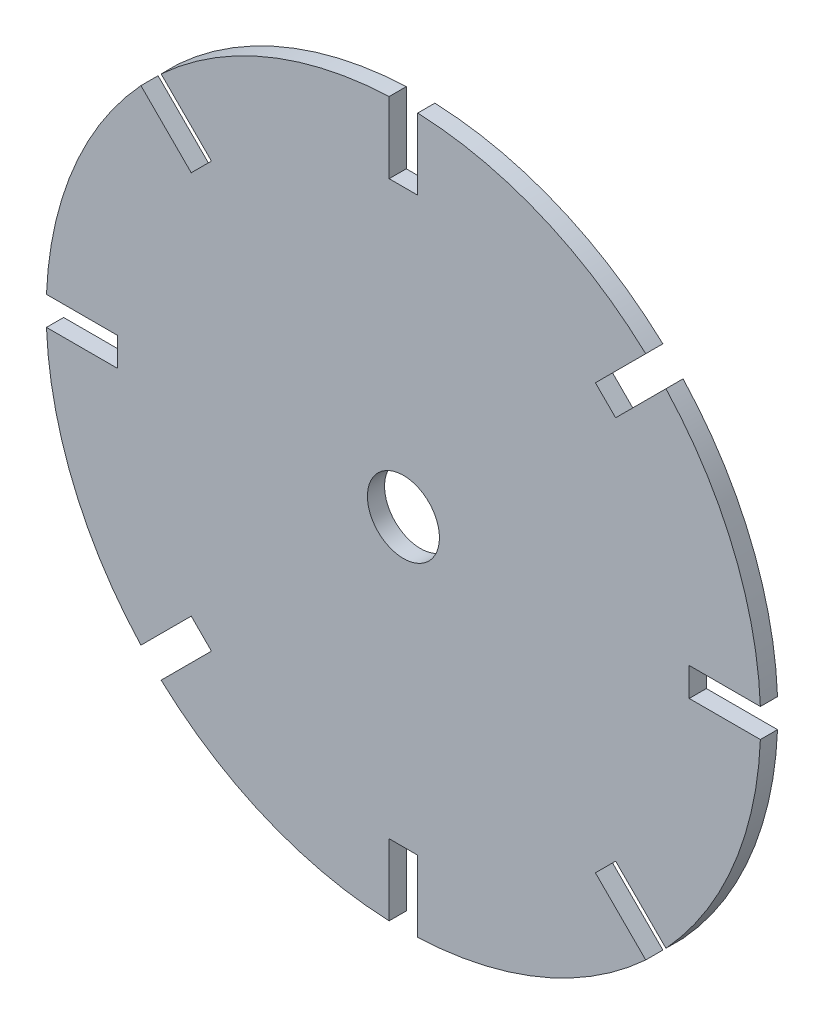
ISO-10303-21;
HEADER;
FILE_DESCRIPTION(('STEP AP214'),'2;1');
FILE_NAME('part.step','',(''),(''),'','','');
FILE_SCHEMA(('AUTOMOTIVE_DESIGN { 1 0 10303 214 1 1 1 1 }'));
ENDSEC;
DATA;
#1=APPLICATION_CONTEXT('core data for automotive mechanical design processes');
#2=APPLICATION_PROTOCOL_DEFINITION('international standard','automotive_design',2000,#1);
#3=PRODUCT_CONTEXT('',#1,'mechanical');
#4=PRODUCT('Part','Part','',(#3));
#5=PRODUCT_RELATED_PRODUCT_CATEGORY('part','',(#4));
#6=PRODUCT_DEFINITION_FORMATION('','',#4);
#7=PRODUCT_DEFINITION_CONTEXT('part definition',#1,'design');
#8=PRODUCT_DEFINITION('design','',#6,#7);
#9=PRODUCT_DEFINITION_SHAPE('','',#8);
#10=(LENGTH_UNIT() NAMED_UNIT(*) SI_UNIT(.MILLI.,.METRE.));
#11=(NAMED_UNIT(*) PLANE_ANGLE_UNIT() SI_UNIT($,.RADIAN.));
#12=(NAMED_UNIT(*) SI_UNIT($,.STERADIAN.) SOLID_ANGLE_UNIT());
#13=UNCERTAINTY_MEASURE_WITH_UNIT(LENGTH_MEASURE(1.E-05),#10,'distance_accuracy_value','');
#14=(GEOMETRIC_REPRESENTATION_CONTEXT(3) GLOBAL_UNCERTAINTY_ASSIGNED_CONTEXT((#13)) GLOBAL_UNIT_ASSIGNED_CONTEXT((#10,
#11,#12)) REPRESENTATION_CONTEXT('',''));
#15=CARTESIAN_POINT('',(0.,0.,0.));
#16=DIRECTION('',(0.,0.,1.));
#17=DIRECTION('',(1.,0.,0.));
#18=AXIS2_PLACEMENT_3D('',#15,#16,#17);
#19=CARTESIAN_POINT('',(0.,0.,6.));
#20=DIRECTION('',(0.,0.,-1.));
#21=DIRECTION('',(-1.,0.,0.));
#22=AXIS2_PLACEMENT_3D('',#19,#20,#21);
#23=CYLINDRICAL_SURFACE('',#22,125.);
#24=CARTESIAN_POINT('',(0.,0.,0.));
#25=DIRECTION('',(0.,0.,1.));
#26=DIRECTION('',(1.,0.,0.));
#27=AXIS2_PLACEMENT_3D('',#24,#25,#26);
#28=CIRCLE('',#27,125.);
#29=CARTESIAN_POINT('',(-5.,124.899959967968,0.));
#30=VERTEX_POINT('',#29);
#31=CARTESIAN_POINT('',(-84.7820747573446,91.8531425692122,0.));
#32=VERTEX_POINT('',#31);
#33=EDGE_CURVE('E449',#30,#32,#28,.T.);
#34=ORIENTED_EDGE('',*,*,#33,.T.);
#35=DIRECTION('',(0.,0.,-1.));
#36=VECTOR('',#35,1.);
#37=CARTESIAN_POINT('',(-84.7820747573446,91.8531425692122,6.));
#38=LINE('',#37,#36);
#39=CARTESIAN_POINT('',(-84.7820747573446,91.8531425692122,6.));
#40=VERTEX_POINT('',#39);
#41=EDGE_CURVE('E274',#32,#40,#38,.F.);
#42=ORIENTED_EDGE('',*,*,#41,.T.);
#43=CARTESIAN_POINT('',(0.,0.,6.));
#44=DIRECTION('',(0.,0.,1.));
#45=DIRECTION('',(1.,0.,0.));
#46=AXIS2_PLACEMENT_3D('',#43,#44,#45);
#47=CIRCLE('',#46,125.);
#48=CARTESIAN_POINT('',(-5.,124.899959967968,6.));
#49=VERTEX_POINT('',#48);
#50=EDGE_CURVE('E262',#49,#40,#47,.T.);
#51=ORIENTED_EDGE('',*,*,#50,.F.);
#52=DIRECTION('',(0.,0.,-1.));
#53=VECTOR('',#52,1.);
#54=CARTESIAN_POINT('',(-5.,124.899959967968,6.));
#55=LINE('',#54,#53);
#56=EDGE_CURVE('E446',#49,#30,#55,.T.);
#57=ORIENTED_EDGE('',*,*,#56,.T.);
#58=EDGE_LOOP('',(#34,#42,#51,#57));
#59=FACE_BOUND('',#58,.T.);
#60=ADVANCED_FACE('F33',(#59),#23,.T.);
#61=CARTESIAN_POINT('',(-91.8531425692102,84.7820747573468,6.));
#62=VERTEX_POINT('',#61);
#63=CARTESIAN_POINT('',(-124.899959967968,5.00000000000131,6.));
#64=VERTEX_POINT('',#63);
#65=EDGE_CURVE('E447',#62,#64,#47,.T.);
#66=ORIENTED_EDGE('',*,*,#65,.F.);
#67=DIRECTION('',(0.,0.,-1.));
#68=VECTOR('',#67,1.);
#69=CARTESIAN_POINT('',(-91.8531425692102,84.7820747573468,6.));
#70=LINE('',#69,#68);
#71=CARTESIAN_POINT('',(-91.8531425692102,84.7820747573468,0.));
#72=VERTEX_POINT('',#71);
#73=EDGE_CURVE('E270',#62,#72,#70,.T.);
#74=ORIENTED_EDGE('',*,*,#73,.T.);
#75=CARTESIAN_POINT('',(-124.899959967968,5.00000000000131,0.));
#76=VERTEX_POINT('',#75);
#77=EDGE_CURVE('E452',#72,#76,#28,.T.);
#78=ORIENTED_EDGE('',*,*,#77,.T.);
#79=DIRECTION('',(0.,0.,-1.));
#80=VECTOR('',#79,1.);
#81=CARTESIAN_POINT('',(-124.899959967968,5.00000000000131,6.));
#82=LINE('',#81,#80);
#83=EDGE_CURVE('E295',#76,#64,#82,.F.);
#84=ORIENTED_EDGE('',*,*,#83,.T.);
#85=EDGE_LOOP('',(#66,#74,#78,#84));
#86=FACE_BOUND('',#85,.T.);
#87=ADVANCED_FACE('F486',(#86),#23,.T.);
#88=CARTESIAN_POINT('',(-124.899959967968,-4.99999999999869,6.));
#89=VERTEX_POINT('',#88);
#90=CARTESIAN_POINT('',(-91.853142569212,-84.7820747573449,6.));
#91=VERTEX_POINT('',#90);
#92=EDGE_CURVE('E534',#89,#91,#47,.T.);
#93=ORIENTED_EDGE('',*,*,#92,.F.);
#94=DIRECTION('',(0.,0.,-1.));
#95=VECTOR('',#94,1.);
#96=CARTESIAN_POINT('',(-124.899959967968,-4.99999999999869,6.));
#97=LINE('',#96,#95);
#98=CARTESIAN_POINT('',(-124.899959967968,-4.99999999999869,0.));
#99=VERTEX_POINT('',#98);
#100=EDGE_CURVE('E291',#89,#99,#97,.T.);
#101=ORIENTED_EDGE('',*,*,#100,.T.);
#102=CARTESIAN_POINT('',(-91.853142569212,-84.7820747573449,0.));
#103=VERTEX_POINT('',#102);
#104=EDGE_CURVE('E487',#99,#103,#28,.T.);
#105=ORIENTED_EDGE('',*,*,#104,.T.);
#106=DIRECTION('',(0.,0.,-1.));
#107=VECTOR('',#106,1.);
#108=CARTESIAN_POINT('',(-91.8531425692119,-84.7820747573449,6.));
#109=LINE('',#108,#107);
#110=EDGE_CURVE('E319',#103,#91,#109,.F.);
#111=ORIENTED_EDGE('',*,*,#110,.T.);
#112=EDGE_LOOP('',(#93,#101,#105,#111));
#113=FACE_BOUND('',#112,.T.);
#114=ADVANCED_FACE('F559',(#113),#23,.T.);
#115=CARTESIAN_POINT('',(-84.7820747573465,-91.8531425692105,6.));
#116=VERTEX_POINT('',#115);
#117=CARTESIAN_POINT('',(-5.,-124.899959967968,6.));
#118=VERTEX_POINT('',#117);
#119=EDGE_CURVE('E531',#116,#118,#47,.T.);
#120=ORIENTED_EDGE('',*,*,#119,.F.);
#121=DIRECTION('',(0.,0.,-1.));
#122=VECTOR('',#121,1.);
#123=CARTESIAN_POINT('',(-84.7820747573465,-91.8531425692105,6.));
#124=LINE('',#123,#122);
#125=CARTESIAN_POINT('',(-84.7820747573465,-91.8531425692105,0.));
#126=VERTEX_POINT('',#125);
#127=EDGE_CURVE('E315',#116,#126,#124,.T.);
#128=ORIENTED_EDGE('',*,*,#127,.T.);
#129=CARTESIAN_POINT('',(-5.,-124.899959967968,0.));
#130=VERTEX_POINT('',#129);
#131=EDGE_CURVE('E488',#126,#130,#28,.T.);
#132=ORIENTED_EDGE('',*,*,#131,.T.);
#133=DIRECTION('',(0.,0.,-1.));
#134=VECTOR('',#133,1.);
#135=CARTESIAN_POINT('',(-5.,-124.899959967968,6.));
#136=LINE('',#135,#134);
#137=EDGE_CURVE('E343',#130,#118,#136,.F.);
#138=ORIENTED_EDGE('',*,*,#137,.T.);
#139=EDGE_LOOP('',(#120,#128,#132,#138));
#140=FACE_BOUND('',#139,.T.);
#141=ADVANCED_FACE('F775',(#140),#23,.T.);
#142=CARTESIAN_POINT('',(5.,-124.899959967968,6.));
#143=VERTEX_POINT('',#142);
#144=CARTESIAN_POINT('',(84.7820747573452,-91.8531425692117,6.));
#145=VERTEX_POINT('',#144);
#146=EDGE_CURVE('E528',#143,#145,#47,.T.);
#147=ORIENTED_EDGE('',*,*,#146,.F.);
#148=DIRECTION('',(0.,0.,-1.));
#149=VECTOR('',#148,1.);
#150=CARTESIAN_POINT('',(5.,-124.899959967968,6.));
#151=LINE('',#150,#149);
#152=CARTESIAN_POINT('',(5.,-124.899959967968,0.));
#153=VERTEX_POINT('',#152);
#154=EDGE_CURVE('E339',#143,#153,#151,.T.);
#155=ORIENTED_EDGE('',*,*,#154,.T.);
#156=CARTESIAN_POINT('',(84.7820747573452,-91.8531425692117,0.));
#157=VERTEX_POINT('',#156);
#158=EDGE_CURVE('E492',#153,#157,#28,.T.);
#159=ORIENTED_EDGE('',*,*,#158,.T.);
#160=DIRECTION('',(0.,0.,-1.));
#161=VECTOR('',#160,1.);
#162=CARTESIAN_POINT('',(84.7820747573452,-91.8531425692116,6.));
#163=LINE('',#162,#161);
#164=EDGE_CURVE('E367',#157,#145,#163,.F.);
#165=ORIENTED_EDGE('',*,*,#164,.T.);
#166=EDGE_LOOP('',(#147,#155,#159,#165));
#167=FACE_BOUND('',#166,.T.);
#168=ADVANCED_FACE('F571',(#167),#23,.T.);
#169=CARTESIAN_POINT('',(91.8531425692107,-84.7820747573462,6.));
#170=VERTEX_POINT('',#169);
#171=CARTESIAN_POINT('',(124.899959967968,-5.00000000000044,6.));
#172=VERTEX_POINT('',#171);
#173=EDGE_CURVE('E525',#170,#172,#47,.T.);
#174=ORIENTED_EDGE('',*,*,#173,.F.);
#175=DIRECTION('',(0.,0.,-1.));
#176=VECTOR('',#175,1.);
#177=CARTESIAN_POINT('',(91.8531425692107,-84.7820747573462,6.));
#178=LINE('',#177,#176);
#179=CARTESIAN_POINT('',(91.8531425692107,-84.7820747573462,0.));
#180=VERTEX_POINT('',#179);
#181=EDGE_CURVE('E363',#170,#180,#178,.T.);
#182=ORIENTED_EDGE('',*,*,#181,.T.);
#183=CARTESIAN_POINT('',(124.899959967968,-5.00000000000044,0.));
#184=VERTEX_POINT('',#183);
#185=EDGE_CURVE('E496',#180,#184,#28,.T.);
#186=ORIENTED_EDGE('',*,*,#185,.T.);
#187=DIRECTION('',(0.,0.,-1.));
#188=VECTOR('',#187,1.);
#189=CARTESIAN_POINT('',(124.899959967968,-5.00000000000044,6.));
#190=LINE('',#189,#188);
#191=EDGE_CURVE('E391',#184,#172,#190,.F.);
#192=ORIENTED_EDGE('',*,*,#191,.T.);
#193=EDGE_LOOP('',(#174,#182,#186,#192));
#194=FACE_BOUND('',#193,.T.);
#195=ADVANCED_FACE('F567',(#194),#23,.T.);
#196=CARTESIAN_POINT('',(124.899959967968,4.99999999999956,6.));
#197=VERTEX_POINT('',#196);
#198=CARTESIAN_POINT('',(91.8531425692114,84.7820747573456,6.));
#199=VERTEX_POINT('',#198);
#200=EDGE_CURVE('E524',#197,#199,#47,.T.);
#201=ORIENTED_EDGE('',*,*,#200,.F.);
#202=DIRECTION('',(0.,0.,-1.));
#203=VECTOR('',#202,1.);
#204=CARTESIAN_POINT('',(124.899959967968,4.99999999999956,6.));
#205=LINE('',#204,#203);
#206=CARTESIAN_POINT('',(124.899959967968,4.99999999999956,0.));
#207=VERTEX_POINT('',#206);
#208=EDGE_CURVE('E387',#197,#207,#205,.T.);
#209=ORIENTED_EDGE('',*,*,#208,.T.);
#210=CARTESIAN_POINT('',(91.8531425692114,84.7820747573456,0.));
#211=VERTEX_POINT('',#210);
#212=EDGE_CURVE('E500',#207,#211,#28,.T.);
#213=ORIENTED_EDGE('',*,*,#212,.T.);
#214=DIRECTION('',(0.,0.,-1.));
#215=VECTOR('',#214,1.);
#216=CARTESIAN_POINT('',(91.8531425692113,84.7820747573455,6.));
#217=LINE('',#216,#215);
#218=EDGE_CURVE('E415',#211,#199,#217,.F.);
#219=ORIENTED_EDGE('',*,*,#218,.T.);
#220=EDGE_LOOP('',(#201,#209,#213,#219));
#221=FACE_BOUND('',#220,.T.);
#222=ADVANCED_FACE('F561',(#221),#23,.T.);
#223=CARTESIAN_POINT('',(84.7820747573459,91.8531425692111,6.));
#224=VERTEX_POINT('',#223);
#225=CARTESIAN_POINT('',(5.,124.899959967968,6.));
#226=VERTEX_POINT('',#225);
#227=EDGE_CURVE('E448',#224,#226,#47,.T.);
#228=ORIENTED_EDGE('',*,*,#227,.F.);
#229=DIRECTION('',(0.,0.,-1.));
#230=VECTOR('',#229,1.);
#231=CARTESIAN_POINT('',(84.7820747573459,91.8531425692111,6.));
#232=LINE('',#231,#230);
#233=CARTESIAN_POINT('',(84.7820747573459,91.8531425692111,0.));
#234=VERTEX_POINT('',#233);
#235=EDGE_CURVE('E411',#224,#234,#232,.T.);
#236=ORIENTED_EDGE('',*,*,#235,.T.);
#237=CARTESIAN_POINT('',(5.,124.899959967968,0.));
#238=VERTEX_POINT('',#237);
#239=EDGE_CURVE('E442',#234,#238,#28,.T.);
#240=ORIENTED_EDGE('',*,*,#239,.T.);
#241=DIRECTION('',(0.,0.,-1.));
#242=VECTOR('',#241,1.);
#243=CARTESIAN_POINT('',(5.,124.899959967968,6.));
#244=LINE('',#243,#242);
#245=EDGE_CURVE('E455',#238,#226,#244,.F.);
#246=ORIENTED_EDGE('',*,*,#245,.T.);
#247=EDGE_LOOP('',(#228,#236,#240,#246));
#248=FACE_BOUND('',#247,.T.);
#249=ADVANCED_FACE('F35',(#248),#23,.T.);
#250=CARTESIAN_POINT('',(0.,0.,6.));
#251=DIRECTION('',(0.,0.,1.));
#252=DIRECTION('',(1.,0.,0.));
#253=AXIS2_PLACEMENT_3D('',#250,#251,#252);
#254=PLANE('',#253);
#255=DIRECTION('',(0.707106781186539,-0.707106781186556,0.));
#256=VECTOR('',#255,1.);
#257=CARTESIAN_POINT('',(-67.1751442127211,74.2462120245883,6.));
#258=LINE('',#257,#256);
#259=CARTESIAN_POINT('',(-67.1751442127211,74.2462120245883,6.));
#260=VERTEX_POINT('',#259);
#261=EDGE_CURVE('E244',#40,#260,#258,.T.);
#262=ORIENTED_EDGE('',*,*,#261,.T.);
#263=DIRECTION('',(-0.707106781186556,-0.707106781186539,0.));
#264=VECTOR('',#263,1.);
#265=CARTESIAN_POINT('',(-67.1751442127211,74.2462120245883,6.));
#266=LINE('',#265,#264);
#267=CARTESIAN_POINT('',(-74.2462120245867,67.1751442127229,6.));
#268=VERTEX_POINT('',#267);
#269=EDGE_CURVE('E251',#260,#268,#266,.T.);
#270=ORIENTED_EDGE('',*,*,#269,.T.);
#271=DIRECTION('',(-0.707106781186539,0.707106781186556,0.));
#272=VECTOR('',#271,1.);
#273=CARTESIAN_POINT('',(-74.2462120245867,67.1751442127229,6.));
#274=LINE('',#273,#272);
#275=EDGE_CURVE('E248',#268,#62,#274,.T.);
#276=ORIENTED_EDGE('',*,*,#275,.T.);
#277=ORIENTED_EDGE('',*,*,#65,.T.);
#278=DIRECTION('',(1.,0.,0.));
#279=VECTOR('',#278,1.);
#280=CARTESIAN_POINT('',(-99.9999999999999,5.00000000000105,6.));
#281=LINE('',#280,#279);
#282=CARTESIAN_POINT('',(-99.9999999999999,5.00000000000105,6.));
#283=VERTEX_POINT('',#282);
#284=EDGE_CURVE('E277',#64,#283,#281,.T.);
#285=ORIENTED_EDGE('',*,*,#284,.T.);
#286=DIRECTION('',(0.,-1.,0.));
#287=VECTOR('',#286,1.);
#288=CARTESIAN_POINT('',(-99.9999999999999,5.00000000000105,6.));
#289=LINE('',#288,#287);
#290=CARTESIAN_POINT('',(-100.,-4.99999999999896,6.));
#291=VERTEX_POINT('',#290);
#292=EDGE_CURVE('E280',#283,#291,#289,.T.);
#293=ORIENTED_EDGE('',*,*,#292,.T.);
#294=DIRECTION('',(-1.,0.,0.));
#295=VECTOR('',#294,1.);
#296=CARTESIAN_POINT('',(-100.,-4.99999999999896,6.));
#297=LINE('',#296,#295);
#298=EDGE_CURVE('E284',#291,#89,#297,.T.);
#299=ORIENTED_EDGE('',*,*,#298,.T.);
#300=ORIENTED_EDGE('',*,*,#92,.T.);
#301=DIRECTION('',(0.707106781186554,0.707106781186541,0.));
#302=VECTOR('',#301,1.);
#303=CARTESIAN_POINT('',(-74.2462120245881,-67.1751442127214,6.));
#304=LINE('',#303,#302);
#305=CARTESIAN_POINT('',(-74.2462120245881,-67.1751442127214,6.));
#306=VERTEX_POINT('',#305);
#307=EDGE_CURVE('E299',#91,#306,#304,.T.);
#308=ORIENTED_EDGE('',*,*,#307,.T.);
#309=DIRECTION('',(0.707106781186541,-0.707106781186554,0.));
#310=VECTOR('',#309,1.);
#311=CARTESIAN_POINT('',(-74.2462120245881,-67.1751442127214,6.));
#312=LINE('',#311,#310);
#313=CARTESIAN_POINT('',(-67.1751442127227,-74.2462120245869,6.));
#314=VERTEX_POINT('',#313);
#315=EDGE_CURVE('E302',#306,#314,#312,.T.);
#316=ORIENTED_EDGE('',*,*,#315,.T.);
#317=DIRECTION('',(-0.707106781186554,-0.707106781186541,0.));
#318=VECTOR('',#317,1.);
#319=CARTESIAN_POINT('',(-67.1751442127227,-74.2462120245869,6.));
#320=LINE('',#319,#318);
#321=EDGE_CURVE('E306',#314,#116,#320,.T.);
#322=ORIENTED_EDGE('',*,*,#321,.T.);
#323=ORIENTED_EDGE('',*,*,#119,.T.);
#324=DIRECTION('',(0.,1.,0.));
#325=VECTOR('',#324,1.);
#326=CARTESIAN_POINT('',(-5.,-100.,6.));
#327=LINE('',#326,#325);
#328=CARTESIAN_POINT('',(-5.,-100.,6.));
#329=VERTEX_POINT('',#328);
#330=EDGE_CURVE('E323',#118,#329,#327,.T.);
#331=ORIENTED_EDGE('',*,*,#330,.T.);
#332=DIRECTION('',(1.,0.,0.));
#333=VECTOR('',#332,1.);
#334=CARTESIAN_POINT('',(-5.,-100.,6.));
#335=LINE('',#334,#333);
#336=CARTESIAN_POINT('',(5.00000000000001,-100.,6.));
#337=VERTEX_POINT('',#336);
#338=EDGE_CURVE('E326',#329,#337,#335,.T.);
#339=ORIENTED_EDGE('',*,*,#338,.T.);
#340=DIRECTION('',(0.,-1.,0.));
#341=VECTOR('',#340,1.);
#342=CARTESIAN_POINT('',(5.00000000000001,-100.,6.));
#343=LINE('',#342,#341);
#344=EDGE_CURVE('E330',#337,#143,#343,.T.);
#345=ORIENTED_EDGE('',*,*,#344,.T.);
#346=ORIENTED_EDGE('',*,*,#146,.T.);
#347=DIRECTION('',(-0.707106781186544,0.707106781186551,0.));
#348=VECTOR('',#347,1.);
#349=CARTESIAN_POINT('',(67.1751442127216,-74.2462120245878,6.));
#350=LINE('',#349,#348);
#351=CARTESIAN_POINT('',(67.1751442127216,-74.2462120245878,6.));
#352=VERTEX_POINT('',#351);
#353=EDGE_CURVE('E347',#145,#352,#350,.T.);
#354=ORIENTED_EDGE('',*,*,#353,.T.);
#355=DIRECTION('',(0.707106781186551,0.707106781186544,0.));
#356=VECTOR('',#355,1.);
#357=CARTESIAN_POINT('',(67.1751442127216,-74.2462120245878,6.));
#358=LINE('',#357,#356);
#359=CARTESIAN_POINT('',(74.2462120245871,-67.1751442127224,6.));
#360=VERTEX_POINT('',#359);
#361=EDGE_CURVE('E350',#352,#360,#358,.T.);
#362=ORIENTED_EDGE('',*,*,#361,.T.);
#363=DIRECTION('',(0.707106781186544,-0.707106781186551,0.));
#364=VECTOR('',#363,1.);
#365=CARTESIAN_POINT('',(74.2462120245871,-67.1751442127224,6.));
#366=LINE('',#365,#364);
#367=EDGE_CURVE('E354',#360,#170,#366,.T.);
#368=ORIENTED_EDGE('',*,*,#367,.T.);
#369=ORIENTED_EDGE('',*,*,#173,.T.);
#370=DIRECTION('',(-1.,0.,0.));
#371=VECTOR('',#370,1.);
#372=CARTESIAN_POINT('',(100.,-5.00000000000035,6.));
#373=LINE('',#372,#371);
#374=CARTESIAN_POINT('',(100.,-5.00000000000035,6.));
#375=VERTEX_POINT('',#374);
#376=EDGE_CURVE('E371',#172,#375,#373,.T.);
#377=ORIENTED_EDGE('',*,*,#376,.T.);
#378=DIRECTION('',(0.,1.,0.));
#379=VECTOR('',#378,1.);
#380=CARTESIAN_POINT('',(100.,-5.00000000000035,6.));
#381=LINE('',#380,#379);
#382=CARTESIAN_POINT('',(100.,4.99999999999966,6.));
#383=VERTEX_POINT('',#382);
#384=EDGE_CURVE('E374',#375,#383,#381,.T.);
#385=ORIENTED_EDGE('',*,*,#384,.T.);
#386=DIRECTION('',(1.,0.,0.));
#387=VECTOR('',#386,1.);
#388=CARTESIAN_POINT('',(100.,4.99999999999966,6.));
#389=LINE('',#388,#387);
#390=EDGE_CURVE('E378',#383,#197,#389,.T.);
#391=ORIENTED_EDGE('',*,*,#390,.T.);
#392=ORIENTED_EDGE('',*,*,#200,.T.);
#393=DIRECTION('',(-0.707106781186549,-0.707106781186546,0.));
#394=VECTOR('',#393,1.);
#395=CARTESIAN_POINT('',(74.2462120245876,67.1751442127219,6.));
#396=LINE('',#395,#394);
#397=CARTESIAN_POINT('',(74.2462120245876,67.1751442127219,6.));
#398=VERTEX_POINT('',#397);
#399=EDGE_CURVE('E395',#199,#398,#396,.T.);
#400=ORIENTED_EDGE('',*,*,#399,.T.);
#401=DIRECTION('',(-0.707106781186546,0.707106781186549,0.));
#402=VECTOR('',#401,1.);
#403=CARTESIAN_POINT('',(74.2462120245876,67.1751442127219,6.));
#404=LINE('',#403,#402);
#405=CARTESIAN_POINT('',(67.1751442127221,74.2462120245874,6.));
#406=VERTEX_POINT('',#405);
#407=EDGE_CURVE('E398',#398,#406,#404,.T.);
#408=ORIENTED_EDGE('',*,*,#407,.T.);
#409=DIRECTION('',(0.707106781186549,0.707106781186546,0.));
#410=VECTOR('',#409,1.);
#411=CARTESIAN_POINT('',(67.1751442127221,74.2462120245874,6.));
#412=LINE('',#411,#410);
#413=EDGE_CURVE('E402',#406,#224,#412,.T.);
#414=ORIENTED_EDGE('',*,*,#413,.T.);
#415=ORIENTED_EDGE('',*,*,#227,.T.);
#416=DIRECTION('',(0.,-1.,0.));
#417=VECTOR('',#416,1.);
#418=CARTESIAN_POINT('',(5.,100.,6.));
#419=LINE('',#418,#417);
#420=CARTESIAN_POINT('',(5.,100.,6.));
#421=VERTEX_POINT('',#420);
#422=EDGE_CURVE('E419',#226,#421,#419,.T.);
#423=ORIENTED_EDGE('',*,*,#422,.T.);
#424=DIRECTION('',(-1.,0.,0.));
#425=VECTOR('',#424,1.);
#426=CARTESIAN_POINT('',(5.,100.,6.));
#427=LINE('',#426,#425);
#428=CARTESIAN_POINT('',(-5.00000000000001,100.,6.));
#429=VERTEX_POINT('',#428);
#430=EDGE_CURVE('E422',#421,#429,#427,.T.);
#431=ORIENTED_EDGE('',*,*,#430,.T.);
#432=DIRECTION('',(0.,1.,0.));
#433=VECTOR('',#432,1.);
#434=CARTESIAN_POINT('',(-5.00000000000001,100.,6.));
#435=LINE('',#434,#433);
#436=EDGE_CURVE('E426',#429,#49,#435,.T.);
#437=ORIENTED_EDGE('',*,*,#436,.T.);
#438=ORIENTED_EDGE('',*,*,#50,.T.);
#439=EDGE_LOOP('',(#262,#270,#276,#277,#285,#293,#299,#300,#308,#316,#322,#323,#331,#339,#345,
#346,#354,#362,#368,#369,#377,#385,#391,#392,#400,#408,#414,#415,#423,#431,#437,#438));
#440=FACE_BOUND('',#439,.T.);
#441=CARTESIAN_POINT('',(0.,0.,6.));
#442=DIRECTION('',(0.,0.,1.));
#443=DIRECTION('',(1.,0.,0.));
#444=AXIS2_PLACEMENT_3D('',#441,#442,#443);
#445=CIRCLE('',#444,12.6);
#446=CARTESIAN_POINT('',(12.6,0.,6.));
#447=VERTEX_POINT('',#446);
#448=EDGE_CURVE('E439',#447,#447,#445,.T.);
#449=ORIENTED_EDGE('',*,*,#448,.F.);
#450=EDGE_LOOP('',(#449));
#451=FACE_BOUND('',#450,.T.);
#452=ADVANCED_FACE('F258',(#440,#451),#254,.T.);
#453=CARTESIAN_POINT('',(0.,0.,0.));
#454=DIRECTION('',(0.,0.,1.));
#455=DIRECTION('',(1.,0.,0.));
#456=AXIS2_PLACEMENT_3D('',#453,#454,#455);
#457=PLANE('',#456);
#458=DIRECTION('',(-0.707106781186556,-0.707106781186539,0.));
#459=VECTOR('',#458,1.);
#460=CARTESIAN_POINT('',(-67.1751442127211,74.2462120245883,0.));
#461=LINE('',#460,#459);
#462=CARTESIAN_POINT('',(-67.1751442127211,74.2462120245883,0.));
#463=VERTEX_POINT('',#462);
#464=CARTESIAN_POINT('',(-74.2462120245867,67.1751442127229,0.));
#465=VERTEX_POINT('',#464);
#466=EDGE_CURVE('E265',#463,#465,#461,.T.);
#467=ORIENTED_EDGE('',*,*,#466,.F.);
#468=DIRECTION('',(-0.707106781186539,0.707106781186556,0.));
#469=VECTOR('',#468,1.);
#470=CARTESIAN_POINT('',(3.53553390593278,3.5355339059327,0.));
#471=LINE('',#470,#469);
#472=EDGE_CURVE('E11',#463,#32,#471,.T.);
#473=ORIENTED_EDGE('',*,*,#472,.T.);
#474=ORIENTED_EDGE('',*,*,#33,.F.);
#475=DIRECTION('',(0.,1.,0.));
#476=VECTOR('',#475,1.);
#477=CARTESIAN_POINT('',(-5.00000000000001,100.,0.));
#478=LINE('',#477,#476);
#479=CARTESIAN_POINT('',(-5.00000000000001,100.,0.));
#480=VERTEX_POINT('',#479);
#481=EDGE_CURVE('E423',#480,#30,#478,.T.);
#482=ORIENTED_EDGE('',*,*,#481,.F.);
#483=DIRECTION('',(-1.,0.,0.));
#484=VECTOR('',#483,1.);
#485=CARTESIAN_POINT('',(5.,100.,0.));
#486=LINE('',#485,#484);
#487=CARTESIAN_POINT('',(5.,100.,0.));
#488=VERTEX_POINT('',#487);
#489=EDGE_CURVE('E430',#488,#480,#486,.T.);
#490=ORIENTED_EDGE('',*,*,#489,.F.);
#491=DIRECTION('',(0.,-1.,0.));
#492=VECTOR('',#491,1.);
#493=CARTESIAN_POINT('',(5.,100.,0.));
#494=LINE('',#493,#492);
#495=EDGE_CURVE('E418',#238,#488,#494,.T.);
#496=ORIENTED_EDGE('',*,*,#495,.F.);
#497=ORIENTED_EDGE('',*,*,#239,.F.);
#498=DIRECTION('',(0.707106781186549,0.707106781186546,0.));
#499=VECTOR('',#498,1.);
#500=CARTESIAN_POINT('',(67.1751442127221,74.2462120245874,0.));
#501=LINE('',#500,#499);
#502=CARTESIAN_POINT('',(67.1751442127221,74.2462120245874,0.));
#503=VERTEX_POINT('',#502);
#504=EDGE_CURVE('E399',#503,#234,#501,.T.);
#505=ORIENTED_EDGE('',*,*,#504,.F.);
#506=DIRECTION('',(-0.707106781186546,0.707106781186549,0.));
#507=VECTOR('',#506,1.);
#508=CARTESIAN_POINT('',(74.2462120245876,67.1751442127219,0.));
#509=LINE('',#508,#507);
#510=CARTESIAN_POINT('',(74.2462120245876,67.1751442127219,0.));
#511=VERTEX_POINT('',#510);
#512=EDGE_CURVE('E394',#511,#503,#509,.T.);
#513=ORIENTED_EDGE('',*,*,#512,.F.);
#514=DIRECTION('',(0.707106781186549,0.707106781186546,0.));
#515=VECTOR('',#514,1.);
#516=CARTESIAN_POINT('',(3.53553390593273,-3.53553390593274,0.));
#517=LINE('',#516,#515);
#518=EDGE_CURVE('E458',#511,#211,#517,.T.);
#519=ORIENTED_EDGE('',*,*,#518,.T.);
#520=ORIENTED_EDGE('',*,*,#212,.F.);
#521=DIRECTION('',(1.,0.,0.));
#522=VECTOR('',#521,1.);
#523=CARTESIAN_POINT('',(100.,4.99999999999966,0.));
#524=LINE('',#523,#522);
#525=CARTESIAN_POINT('',(100.,4.99999999999966,0.));
#526=VERTEX_POINT('',#525);
#527=EDGE_CURVE('E375',#526,#207,#524,.T.);
#528=ORIENTED_EDGE('',*,*,#527,.F.);
#529=DIRECTION('',(0.,1.,0.));
#530=VECTOR('',#529,1.);
#531=CARTESIAN_POINT('',(100.,-5.00000000000035,0.));
#532=LINE('',#531,#530);
#533=CARTESIAN_POINT('',(100.,-5.00000000000035,0.));
#534=VERTEX_POINT('',#533);
#535=EDGE_CURVE('E370',#534,#526,#532,.T.);
#536=ORIENTED_EDGE('',*,*,#535,.F.);
#537=DIRECTION('',(1.,0.,0.));
#538=VECTOR('',#537,1.);
#539=CARTESIAN_POINT('',(0.,-5.,0.));
#540=LINE('',#539,#538);
#541=EDGE_CURVE('E461',#534,#184,#540,.T.);
#542=ORIENTED_EDGE('',*,*,#541,.T.);
#543=ORIENTED_EDGE('',*,*,#185,.F.);
#544=DIRECTION('',(0.707106781186544,-0.707106781186551,0.));
#545=VECTOR('',#544,1.);
#546=CARTESIAN_POINT('',(74.2462120245871,-67.1751442127224,0.));
#547=LINE('',#546,#545);
#548=CARTESIAN_POINT('',(74.2462120245871,-67.1751442127224,0.));
#549=VERTEX_POINT('',#548);
#550=EDGE_CURVE('E351',#549,#180,#547,.T.);
#551=ORIENTED_EDGE('',*,*,#550,.F.);
#552=DIRECTION('',(0.707106781186551,0.707106781186544,0.));
#553=VECTOR('',#552,1.);
#554=CARTESIAN_POINT('',(67.1751442127216,-74.2462120245878,0.));
#555=LINE('',#554,#553);
#556=CARTESIAN_POINT('',(67.1751442127216,-74.2462120245878,0.));
#557=VERTEX_POINT('',#556);
#558=EDGE_CURVE('E346',#557,#549,#555,.T.);
#559=ORIENTED_EDGE('',*,*,#558,.F.);
#560=DIRECTION('',(0.707106781186544,-0.707106781186551,0.));
#561=VECTOR('',#560,1.);
#562=CARTESIAN_POINT('',(-3.53553390593276,-3.53553390593272,0.));
#563=LINE('',#562,#561);
#564=EDGE_CURVE('E464',#557,#157,#563,.T.);
#565=ORIENTED_EDGE('',*,*,#564,.T.);
#566=ORIENTED_EDGE('',*,*,#158,.F.);
#567=DIRECTION('',(0.,-1.,0.));
#568=VECTOR('',#567,1.);
#569=CARTESIAN_POINT('',(5.00000000000001,-100.,0.));
#570=LINE('',#569,#568);
#571=CARTESIAN_POINT('',(5.00000000000001,-100.,0.));
#572=VERTEX_POINT('',#571);
#573=EDGE_CURVE('E327',#572,#153,#570,.T.);
#574=ORIENTED_EDGE('',*,*,#573,.F.);
#575=DIRECTION('',(1.,0.,0.));
#576=VECTOR('',#575,1.);
#577=CARTESIAN_POINT('',(-5.,-100.,0.));
#578=LINE('',#577,#576);
#579=CARTESIAN_POINT('',(-5.,-100.,0.));
#580=VERTEX_POINT('',#579);
#581=EDGE_CURVE('E322',#580,#572,#578,.T.);
#582=ORIENTED_EDGE('',*,*,#581,.F.);
#583=DIRECTION('',(0.,-1.,0.));
#584=VECTOR('',#583,1.);
#585=CARTESIAN_POINT('',(-5.,0.,0.));
#586=LINE('',#585,#584);
#587=EDGE_CURVE('E467',#580,#130,#586,.T.);
#588=ORIENTED_EDGE('',*,*,#587,.T.);
#589=ORIENTED_EDGE('',*,*,#131,.F.);
#590=DIRECTION('',(-0.707106781186554,-0.707106781186541,0.));
#591=VECTOR('',#590,1.);
#592=CARTESIAN_POINT('',(-67.1751442127227,-74.2462120245869,0.));
#593=LINE('',#592,#591);
#594=CARTESIAN_POINT('',(-67.1751442127227,-74.2462120245869,0.));
#595=VERTEX_POINT('',#594);
#596=EDGE_CURVE('E303',#595,#126,#593,.T.);
#597=ORIENTED_EDGE('',*,*,#596,.F.);
#598=DIRECTION('',(0.707106781186541,-0.707106781186554,0.));
#599=VECTOR('',#598,1.);
#600=CARTESIAN_POINT('',(-74.2462120245881,-67.1751442127214,0.));
#601=LINE('',#600,#599);
#602=CARTESIAN_POINT('',(-74.2462120245881,-67.1751442127214,0.));
#603=VERTEX_POINT('',#602);
#604=EDGE_CURVE('E298',#603,#595,#601,.T.);
#605=ORIENTED_EDGE('',*,*,#604,.F.);
#606=DIRECTION('',(-0.707106781186554,-0.707106781186541,0.));
#607=VECTOR('',#606,1.);
#608=CARTESIAN_POINT('',(-3.53553390593271,3.53553390593277,0.));
#609=LINE('',#608,#607);
#610=EDGE_CURVE('E470',#603,#103,#609,.T.);
#611=ORIENTED_EDGE('',*,*,#610,.T.);
#612=ORIENTED_EDGE('',*,*,#104,.F.);
#613=DIRECTION('',(-1.,0.,0.));
#614=VECTOR('',#613,1.);
#615=CARTESIAN_POINT('',(-100.,-4.99999999999896,0.));
#616=LINE('',#615,#614);
#617=CARTESIAN_POINT('',(-100.,-4.99999999999896,0.));
#618=VERTEX_POINT('',#617);
#619=EDGE_CURVE('E281',#618,#99,#616,.T.);
#620=ORIENTED_EDGE('',*,*,#619,.F.);
#621=DIRECTION('',(0.,-1.,0.));
#622=VECTOR('',#621,1.);
#623=CARTESIAN_POINT('',(-99.9999999999999,5.00000000000105,0.));
#624=LINE('',#623,#622);
#625=CARTESIAN_POINT('',(-99.9999999999999,5.00000000000105,0.));
#626=VERTEX_POINT('',#625);
#627=EDGE_CURVE('E276',#626,#618,#624,.T.);
#628=ORIENTED_EDGE('',*,*,#627,.F.);
#629=DIRECTION('',(-1.,0.,0.));
#630=VECTOR('',#629,1.);
#631=CARTESIAN_POINT('',(0.,5.,0.));
#632=LINE('',#631,#630);
#633=EDGE_CURVE('E41',#626,#76,#632,.T.);
#634=ORIENTED_EDGE('',*,*,#633,.T.);
#635=ORIENTED_EDGE('',*,*,#77,.F.);
#636=DIRECTION('',(-0.707106781186539,0.707106781186556,0.));
#637=VECTOR('',#636,1.);
#638=CARTESIAN_POINT('',(-74.2462120245867,67.1751442127229,0.));
#639=LINE('',#638,#637);
#640=EDGE_CURVE('E263',#465,#72,#639,.T.);
#641=ORIENTED_EDGE('',*,*,#640,.F.);
#642=EDGE_LOOP('',(#467,#473,#474,#482,#490,#496,#497,#505,#513,#519,#520,#528,#536,#542,#543,
#551,#559,#565,#566,#574,#582,#588,#589,#597,#605,#611,#612,#620,#628,#634,#635,#641));
#643=FACE_BOUND('',#642,.T.);
#644=CARTESIAN_POINT('',(0.,0.,0.));
#645=DIRECTION('',(0.,0.,1.));
#646=DIRECTION('',(1.,0.,0.));
#647=AXIS2_PLACEMENT_3D('',#644,#645,#646);
#648=CIRCLE('',#647,12.6);
#649=CARTESIAN_POINT('',(12.6,0.,0.));
#650=VERTEX_POINT('',#649);
#651=EDGE_CURVE('E436',#650,#650,#648,.T.);
#652=ORIENTED_EDGE('',*,*,#651,.T.);
#653=EDGE_LOOP('',(#652));
#654=FACE_BOUND('',#653,.T.);
#655=ADVANCED_FACE('F476',(#643,#654),#457,.F.);
#656=CARTESIAN_POINT('',(0.,0.,6.));
#657=DIRECTION('',(0.,0.,-1.));
#658=DIRECTION('',(-1.,0.,0.));
#659=AXIS2_PLACEMENT_3D('',#656,#657,#658);
#660=CYLINDRICAL_SURFACE('',#659,12.6);
#661=ORIENTED_EDGE('',*,*,#448,.T.);
#662=EDGE_LOOP('',(#661));
#663=FACE_BOUND('',#662,.T.);
#664=ORIENTED_EDGE('',*,*,#651,.F.);
#665=EDGE_LOOP('',(#664));
#666=FACE_BOUND('',#665,.T.);
#667=ADVANCED_FACE('F552',(#663,#666),#660,.F.);
#668=CARTESIAN_POINT('',(5.,100.,6.));
#669=DIRECTION('',(1.,0.,0.));
#670=DIRECTION('',(0.,0.,-1.));
#671=AXIS2_PLACEMENT_3D('',#668,#669,#670);
#672=PLANE('',#671);
#673=ORIENTED_EDGE('',*,*,#495,.T.);
#674=DIRECTION('',(0.,0.,-1.));
#675=VECTOR('',#674,1.);
#676=CARTESIAN_POINT('',(5.,100.,6.));
#677=LINE('',#676,#675);
#678=EDGE_CURVE('E428',#421,#488,#677,.T.);
#679=ORIENTED_EDGE('',*,*,#678,.F.);
#680=ORIENTED_EDGE('',*,*,#422,.F.);
#681=ORIENTED_EDGE('',*,*,#245,.F.);
#682=EDGE_LOOP('',(#673,#679,#680,#681));
#683=FACE_BOUND('',#682,.T.);
#684=ADVANCED_FACE('F515',(#683),#672,.F.);
#685=CARTESIAN_POINT('',(-5.00000000000001,100.,6.));
#686=DIRECTION('',(-1.,0.,0.));
#687=DIRECTION('',(0.,-1.,0.));
#688=AXIS2_PLACEMENT_3D('',#685,#686,#687);
#689=PLANE('',#688);
#690=ORIENTED_EDGE('',*,*,#436,.F.);
#691=DIRECTION('',(0.,0.,-1.));
#692=VECTOR('',#691,1.);
#693=CARTESIAN_POINT('',(-5.00000000000001,100.,6.));
#694=LINE('',#693,#692);
#695=EDGE_CURVE('E434',#429,#480,#694,.T.);
#696=ORIENTED_EDGE('',*,*,#695,.T.);
#697=ORIENTED_EDGE('',*,*,#481,.T.);
#698=ORIENTED_EDGE('',*,*,#56,.F.);
#699=EDGE_LOOP('',(#690,#696,#697,#698));
#700=FACE_BOUND('',#699,.T.);
#701=ADVANCED_FACE('F543',(#700),#689,.F.);
#702=CARTESIAN_POINT('',(5.,100.,6.));
#703=DIRECTION('',(0.,-1.,0.));
#704=DIRECTION('',(0.,0.,-1.));
#705=AXIS2_PLACEMENT_3D('',#702,#703,#704);
#706=PLANE('',#705);
#707=ORIENTED_EDGE('',*,*,#489,.T.);
#708=ORIENTED_EDGE('',*,*,#695,.F.);
#709=ORIENTED_EDGE('',*,*,#430,.F.);
#710=ORIENTED_EDGE('',*,*,#678,.T.);
#711=EDGE_LOOP('',(#707,#708,#709,#710));
#712=FACE_BOUND('',#711,.T.);
#713=ADVANCED_FACE('F520',(#712),#706,.F.);
#714=CARTESIAN_POINT('',(74.2462120245876,67.1751442127219,6.));
#715=DIRECTION('',(0.707106781186546,-0.707106781186549,0.));
#716=DIRECTION('',(0.707106781186549,0.707106781186546,0.));
#717=AXIS2_PLACEMENT_3D('',#714,#715,#716);
#718=PLANE('',#717);
#719=ORIENTED_EDGE('',*,*,#518,.F.);
#720=DIRECTION('',(0.,0.,-1.));
#721=VECTOR('',#720,1.);
#722=CARTESIAN_POINT('',(74.2462120245876,67.1751442127219,6.));
#723=LINE('',#722,#721);
#724=EDGE_CURVE('E405',#398,#511,#723,.T.);
#725=ORIENTED_EDGE('',*,*,#724,.F.);
#726=ORIENTED_EDGE('',*,*,#399,.F.);
#727=ORIENTED_EDGE('',*,*,#218,.F.);
#728=EDGE_LOOP('',(#719,#725,#726,#727));
#729=FACE_BOUND('',#728,.T.);
#730=ADVANCED_FACE('F550',(#729),#718,.F.);
#731=CARTESIAN_POINT('',(67.1751442127221,74.2462120245874,6.));
#732=DIRECTION('',(-0.707106781186546,0.707106781186549,0.));
#733=DIRECTION('',(-0.707106781186549,-0.707106781186546,0.));
#734=AXIS2_PLACEMENT_3D('',#731,#732,#733);
#735=PLANE('',#734);
#736=ORIENTED_EDGE('',*,*,#413,.F.);
#737=DIRECTION('',(0.,0.,-1.));
#738=VECTOR('',#737,1.);
#739=CARTESIAN_POINT('',(67.1751442127221,74.2462120245874,6.));
#740=LINE('',#739,#738);
#741=EDGE_CURVE('E409',#406,#503,#740,.T.);
#742=ORIENTED_EDGE('',*,*,#741,.T.);
#743=ORIENTED_EDGE('',*,*,#504,.T.);
#744=ORIENTED_EDGE('',*,*,#235,.F.);
#745=EDGE_LOOP('',(#736,#742,#743,#744));
#746=FACE_BOUND('',#745,.T.);
#747=ADVANCED_FACE('F580',(#746),#735,.F.);
#748=CARTESIAN_POINT('',(74.2462120245876,67.1751442127219,6.));
#749=DIRECTION('',(-0.707106781186549,-0.707106781186546,0.));
#750=DIRECTION('',(0.707106781186546,-0.707106781186549,0.));
#751=AXIS2_PLACEMENT_3D('',#748,#749,#750);
#752=PLANE('',#751);
#753=ORIENTED_EDGE('',*,*,#512,.T.);
#754=ORIENTED_EDGE('',*,*,#741,.F.);
#755=ORIENTED_EDGE('',*,*,#407,.F.);
#756=ORIENTED_EDGE('',*,*,#724,.T.);
#757=EDGE_LOOP('',(#753,#754,#755,#756));
#758=FACE_BOUND('',#757,.T.);
#759=ADVANCED_FACE('F577',(#758),#752,.F.);
#760=CARTESIAN_POINT('',(100.,-5.00000000000035,6.));
#761=DIRECTION('',(0.,-1.,0.));
#762=DIRECTION('',(1.,0.,0.));
#763=AXIS2_PLACEMENT_3D('',#760,#761,#762);
#764=PLANE('',#763);
#765=ORIENTED_EDGE('',*,*,#541,.F.);
#766=DIRECTION('',(0.,0.,-1.));
#767=VECTOR('',#766,1.);
#768=CARTESIAN_POINT('',(100.,-5.00000000000035,6.));
#769=LINE('',#768,#767);
#770=EDGE_CURVE('E381',#375,#534,#769,.T.);
#771=ORIENTED_EDGE('',*,*,#770,.F.);
#772=ORIENTED_EDGE('',*,*,#376,.F.);
#773=ORIENTED_EDGE('',*,*,#191,.F.);
#774=EDGE_LOOP('',(#765,#771,#772,#773));
#775=FACE_BOUND('',#774,.T.);
#776=ADVANCED_FACE('F587',(#775),#764,.F.);
#777=CARTESIAN_POINT('',(100.,4.99999999999966,6.));
#778=DIRECTION('',(0.,1.,0.));
#779=DIRECTION('',(-1.,0.,0.));
#780=AXIS2_PLACEMENT_3D('',#777,#778,#779);
#781=PLANE('',#780);
#782=ORIENTED_EDGE('',*,*,#390,.F.);
#783=DIRECTION('',(0.,0.,-1.));
#784=VECTOR('',#783,1.);
#785=CARTESIAN_POINT('',(100.,4.99999999999966,6.));
#786=LINE('',#785,#784);
#787=EDGE_CURVE('E385',#383,#526,#786,.T.);
#788=ORIENTED_EDGE('',*,*,#787,.T.);
#789=ORIENTED_EDGE('',*,*,#527,.T.);
#790=ORIENTED_EDGE('',*,*,#208,.F.);
#791=EDGE_LOOP('',(#782,#788,#789,#790));
#792=FACE_BOUND('',#791,.T.);
#793=ADVANCED_FACE('F592',(#792),#781,.F.);
#794=CARTESIAN_POINT('',(100.,-5.00000000000035,6.));
#795=DIRECTION('',(-1.,0.,0.));
#796=DIRECTION('',(0.,-1.,0.));
#797=AXIS2_PLACEMENT_3D('',#794,#795,#796);
#798=PLANE('',#797);
#799=ORIENTED_EDGE('',*,*,#535,.T.);
#800=ORIENTED_EDGE('',*,*,#787,.F.);
#801=ORIENTED_EDGE('',*,*,#384,.F.);
#802=ORIENTED_EDGE('',*,*,#770,.T.);
#803=EDGE_LOOP('',(#799,#800,#801,#802));
#804=FACE_BOUND('',#803,.T.);
#805=ADVANCED_FACE('F594',(#804),#798,.F.);
#806=CARTESIAN_POINT('',(67.1751442127216,-74.2462120245878,6.));
#807=DIRECTION('',(-0.707106781186551,-0.707106781186544,0.));
#808=DIRECTION('',(0.707106781186544,-0.707106781186551,0.));
#809=AXIS2_PLACEMENT_3D('',#806,#807,#808);
#810=PLANE('',#809);
#811=ORIENTED_EDGE('',*,*,#564,.F.);
#812=DIRECTION('',(0.,0.,-1.));
#813=VECTOR('',#812,1.);
#814=CARTESIAN_POINT('',(67.1751442127216,-74.2462120245878,6.));
#815=LINE('',#814,#813);
#816=EDGE_CURVE('E357',#352,#557,#815,.T.);
#817=ORIENTED_EDGE('',*,*,#816,.F.);
#818=ORIENTED_EDGE('',*,*,#353,.F.);
#819=ORIENTED_EDGE('',*,*,#164,.F.);
#820=EDGE_LOOP('',(#811,#817,#818,#819));
#821=FACE_BOUND('',#820,.T.);
#822=ADVANCED_FACE('F597',(#821),#810,.F.);
#823=CARTESIAN_POINT('',(74.2462120245871,-67.1751442127224,6.));
#824=DIRECTION('',(0.707106781186551,0.707106781186544,0.));
#825=DIRECTION('',(-0.707106781186544,0.707106781186551,0.));
#826=AXIS2_PLACEMENT_3D('',#823,#824,#825);
#827=PLANE('',#826);
#828=ORIENTED_EDGE('',*,*,#367,.F.);
#829=DIRECTION('',(0.,0.,-1.));
#830=VECTOR('',#829,1.);
#831=CARTESIAN_POINT('',(74.2462120245871,-67.1751442127224,6.));
#832=LINE('',#831,#830);
#833=EDGE_CURVE('E361',#360,#549,#832,.T.);
#834=ORIENTED_EDGE('',*,*,#833,.T.);
#835=ORIENTED_EDGE('',*,*,#550,.T.);
#836=ORIENTED_EDGE('',*,*,#181,.F.);
#837=EDGE_LOOP('',(#828,#834,#835,#836));
#838=FACE_BOUND('',#837,.T.);
#839=ADVANCED_FACE('F604',(#838),#827,.F.);
#840=CARTESIAN_POINT('',(67.1751442127216,-74.2462120245878,6.));
#841=DIRECTION('',(-0.707106781186544,0.707106781186551,0.));
#842=DIRECTION('',(-0.707106781186551,-0.707106781186544,0.));
#843=AXIS2_PLACEMENT_3D('',#840,#841,#842);
#844=PLANE('',#843);
#845=ORIENTED_EDGE('',*,*,#558,.T.);
#846=ORIENTED_EDGE('',*,*,#833,.F.);
#847=ORIENTED_EDGE('',*,*,#361,.F.);
#848=ORIENTED_EDGE('',*,*,#816,.T.);
#849=EDGE_LOOP('',(#845,#846,#847,#848));
#850=FACE_BOUND('',#849,.T.);
#851=ADVANCED_FACE('F606',(#850),#844,.F.);
#852=CARTESIAN_POINT('',(-5.,-100.,6.));
#853=DIRECTION('',(-1.,0.,0.));
#854=DIRECTION('',(0.,0.,1.));
#855=AXIS2_PLACEMENT_3D('',#852,#853,#854);
#856=PLANE('',#855);
#857=ORIENTED_EDGE('',*,*,#587,.F.);
#858=DIRECTION('',(0.,0.,-1.));
#859=VECTOR('',#858,1.);
#860=CARTESIAN_POINT('',(-5.,-100.,6.));
#861=LINE('',#860,#859);
#862=EDGE_CURVE('E333',#329,#580,#861,.T.);
#863=ORIENTED_EDGE('',*,*,#862,.F.);
#864=ORIENTED_EDGE('',*,*,#330,.F.);
#865=ORIENTED_EDGE('',*,*,#137,.F.);
#866=EDGE_LOOP('',(#857,#863,#864,#865));
#867=FACE_BOUND('',#866,.T.);
#868=ADVANCED_FACE('F609',(#867),#856,.F.);
#869=CARTESIAN_POINT('',(5.00000000000001,-100.,6.));
#870=DIRECTION('',(1.,0.,0.));
#871=DIRECTION('',(0.,1.,0.));
#872=AXIS2_PLACEMENT_3D('',#869,#870,#871);
#873=PLANE('',#872);
#874=ORIENTED_EDGE('',*,*,#344,.F.);
#875=DIRECTION('',(0.,0.,-1.));
#876=VECTOR('',#875,1.);
#877=CARTESIAN_POINT('',(5.00000000000001,-100.,6.));
#878=LINE('',#877,#876);
#879=EDGE_CURVE('E337',#337,#572,#878,.T.);
#880=ORIENTED_EDGE('',*,*,#879,.T.);
#881=ORIENTED_EDGE('',*,*,#573,.T.);
#882=ORIENTED_EDGE('',*,*,#154,.F.);
#883=EDGE_LOOP('',(#874,#880,#881,#882));
#884=FACE_BOUND('',#883,.T.);
#885=ADVANCED_FACE('F616',(#884),#873,.F.);
#886=CARTESIAN_POINT('',(-5.,-100.,6.));
#887=DIRECTION('',(0.,1.,0.));
#888=DIRECTION('',(0.,0.,1.));
#889=AXIS2_PLACEMENT_3D('',#886,#887,#888);
#890=PLANE('',#889);
#891=ORIENTED_EDGE('',*,*,#581,.T.);
#892=ORIENTED_EDGE('',*,*,#879,.F.);
#893=ORIENTED_EDGE('',*,*,#338,.F.);
#894=ORIENTED_EDGE('',*,*,#862,.T.);
#895=EDGE_LOOP('',(#891,#892,#893,#894));
#896=FACE_BOUND('',#895,.T.);
#897=ADVANCED_FACE('F618',(#896),#890,.F.);
#898=CARTESIAN_POINT('',(-74.2462120245881,-67.1751442127214,6.));
#899=DIRECTION('',(-0.707106781186541,0.707106781186554,0.));
#900=DIRECTION('',(-0.707106781186554,-0.707106781186541,0.));
#901=AXIS2_PLACEMENT_3D('',#898,#899,#900);
#902=PLANE('',#901);
#903=ORIENTED_EDGE('',*,*,#610,.F.);
#904=DIRECTION('',(0.,0.,-1.));
#905=VECTOR('',#904,1.);
#906=CARTESIAN_POINT('',(-74.2462120245881,-67.1751442127214,6.));
#907=LINE('',#906,#905);
#908=EDGE_CURVE('E309',#306,#603,#907,.T.);
#909=ORIENTED_EDGE('',*,*,#908,.F.);
#910=ORIENTED_EDGE('',*,*,#307,.F.);
#911=ORIENTED_EDGE('',*,*,#110,.F.);
#912=EDGE_LOOP('',(#903,#909,#910,#911));
#913=FACE_BOUND('',#912,.T.);
#914=ADVANCED_FACE('F621',(#913),#902,.F.);
#915=CARTESIAN_POINT('',(-67.1751442127227,-74.2462120245869,6.));
#916=DIRECTION('',(0.707106781186541,-0.707106781186554,0.));
#917=DIRECTION('',(0.707106781186554,0.707106781186541,0.));
#918=AXIS2_PLACEMENT_3D('',#915,#916,#917);
#919=PLANE('',#918);
#920=ORIENTED_EDGE('',*,*,#321,.F.);
#921=DIRECTION('',(0.,0.,-1.));
#922=VECTOR('',#921,1.);
#923=CARTESIAN_POINT('',(-67.1751442127227,-74.2462120245869,6.));
#924=LINE('',#923,#922);
#925=EDGE_CURVE('E313',#314,#595,#924,.T.);
#926=ORIENTED_EDGE('',*,*,#925,.T.);
#927=ORIENTED_EDGE('',*,*,#596,.T.);
#928=ORIENTED_EDGE('',*,*,#127,.F.);
#929=EDGE_LOOP('',(#920,#926,#927,#928));
#930=FACE_BOUND('',#929,.T.);
#931=ADVANCED_FACE('F628',(#930),#919,.F.);
#932=CARTESIAN_POINT('',(-74.2462120245881,-67.1751442127214,6.));
#933=DIRECTION('',(0.707106781186554,0.707106781186541,0.));
#934=DIRECTION('',(-0.707106781186541,0.707106781186554,0.));
#935=AXIS2_PLACEMENT_3D('',#932,#933,#934);
#936=PLANE('',#935);
#937=ORIENTED_EDGE('',*,*,#604,.T.);
#938=ORIENTED_EDGE('',*,*,#925,.F.);
#939=ORIENTED_EDGE('',*,*,#315,.F.);
#940=ORIENTED_EDGE('',*,*,#908,.T.);
#941=EDGE_LOOP('',(#937,#938,#939,#940));
#942=FACE_BOUND('',#941,.T.);
#943=ADVANCED_FACE('F630',(#942),#936,.F.);
#944=CARTESIAN_POINT('',(-99.9999999999999,5.00000000000105,6.));
#945=DIRECTION('',(0.,1.,0.));
#946=DIRECTION('',(-1.,0.,0.));
#947=AXIS2_PLACEMENT_3D('',#944,#945,#946);
#948=PLANE('',#947);
#949=ORIENTED_EDGE('',*,*,#633,.F.);
#950=DIRECTION('',(0.,0.,-1.));
#951=VECTOR('',#950,1.);
#952=CARTESIAN_POINT('',(-99.9999999999999,5.00000000000105,6.));
#953=LINE('',#952,#951);
#954=EDGE_CURVE('E56',#283,#626,#953,.T.);
#955=ORIENTED_EDGE('',*,*,#954,.F.);
#956=ORIENTED_EDGE('',*,*,#284,.F.);
#957=ORIENTED_EDGE('',*,*,#83,.F.);
#958=EDGE_LOOP('',(#949,#955,#956,#957));
#959=FACE_BOUND('',#958,.T.);
#960=ADVANCED_FACE('F482',(#959),#948,.F.);
#961=CARTESIAN_POINT('',(-100.,-4.99999999999896,6.));
#962=DIRECTION('',(0.,-1.,0.));
#963=DIRECTION('',(1.,0.,0.));
#964=AXIS2_PLACEMENT_3D('',#961,#962,#963);
#965=PLANE('',#964);
#966=ORIENTED_EDGE('',*,*,#298,.F.);
#967=DIRECTION('',(0.,0.,-1.));
#968=VECTOR('',#967,1.);
#969=CARTESIAN_POINT('',(-100.,-4.99999999999896,6.));
#970=LINE('',#969,#968);
#971=EDGE_CURVE('E289',#291,#618,#970,.T.);
#972=ORIENTED_EDGE('',*,*,#971,.T.);
#973=ORIENTED_EDGE('',*,*,#619,.T.);
#974=ORIENTED_EDGE('',*,*,#100,.F.);
#975=EDGE_LOOP('',(#966,#972,#973,#974));
#976=FACE_BOUND('',#975,.T.);
#977=ADVANCED_FACE('F639',(#976),#965,.F.);
#978=CARTESIAN_POINT('',(-99.9999999999999,5.00000000000105,6.));
#979=DIRECTION('',(1.,0.,0.));
#980=DIRECTION('',(0.,1.,0.));
#981=AXIS2_PLACEMENT_3D('',#978,#979,#980);
#982=PLANE('',#981);
#983=ORIENTED_EDGE('',*,*,#627,.T.);
#984=ORIENTED_EDGE('',*,*,#971,.F.);
#985=ORIENTED_EDGE('',*,*,#292,.F.);
#986=ORIENTED_EDGE('',*,*,#954,.T.);
#987=EDGE_LOOP('',(#983,#984,#985,#986));
#988=FACE_BOUND('',#987,.T.);
#989=ADVANCED_FACE('F640',(#988),#982,.F.);
#990=CARTESIAN_POINT('',(-67.1751442127211,74.2462120245883,6.));
#991=DIRECTION('',(0.707106781186556,0.707106781186539,0.));
#992=DIRECTION('',(-0.707106781186539,0.707106781186556,0.));
#993=AXIS2_PLACEMENT_3D('',#990,#991,#992);
#994=PLANE('',#993);
#995=ORIENTED_EDGE('',*,*,#472,.F.);
#996=DIRECTION('',(0.,0.,-1.));
#997=VECTOR('',#996,1.);
#998=CARTESIAN_POINT('',(-67.1751442127211,74.2462120245883,6.));
#999=LINE('',#998,#997);
#1000=EDGE_CURVE('E48',#260,#463,#999,.T.);
#1001=ORIENTED_EDGE('',*,*,#1000,.F.);
#1002=ORIENTED_EDGE('',*,*,#261,.F.);
#1003=ORIENTED_EDGE('',*,*,#41,.F.);
#1004=EDGE_LOOP('',(#995,#1001,#1002,#1003));
#1005=FACE_BOUND('',#1004,.T.);
#1006=ADVANCED_FACE('F242',(#1005),#994,.F.);
#1007=CARTESIAN_POINT('',(-74.2462120245867,67.1751442127229,6.));
#1008=DIRECTION('',(-0.707106781186556,-0.707106781186539,0.));
#1009=DIRECTION('',(0.707106781186539,-0.707106781186556,0.));
#1010=AXIS2_PLACEMENT_3D('',#1007,#1008,#1009);
#1011=PLANE('',#1010);
#1012=ORIENTED_EDGE('',*,*,#275,.F.);
#1013=DIRECTION('',(0.,0.,-1.));
#1014=VECTOR('',#1013,1.);
#1015=CARTESIAN_POINT('',(-74.2462120245867,67.1751442127229,6.));
#1016=LINE('',#1015,#1014);
#1017=EDGE_CURVE('E247',#268,#465,#1016,.T.);
#1018=ORIENTED_EDGE('',*,*,#1017,.T.);
#1019=ORIENTED_EDGE('',*,*,#640,.T.);
#1020=ORIENTED_EDGE('',*,*,#73,.F.);
#1021=EDGE_LOOP('',(#1012,#1018,#1019,#1020));
#1022=FACE_BOUND('',#1021,.T.);
#1023=ADVANCED_FACE('F540',(#1022),#1011,.F.);
#1024=CARTESIAN_POINT('',(-67.1751442127211,74.2462120245883,6.));
#1025=DIRECTION('',(0.707106781186539,-0.707106781186556,0.));
#1026=DIRECTION('',(0.707106781186556,0.707106781186539,0.));
#1027=AXIS2_PLACEMENT_3D('',#1024,#1025,#1026);
#1028=PLANE('',#1027);
#1029=ORIENTED_EDGE('',*,*,#466,.T.);
#1030=ORIENTED_EDGE('',*,*,#1017,.F.);
#1031=ORIENTED_EDGE('',*,*,#269,.F.);
#1032=ORIENTED_EDGE('',*,*,#1000,.T.);
#1033=EDGE_LOOP('',(#1029,#1030,#1031,#1032));
#1034=FACE_BOUND('',#1033,.T.);
#1035=ADVANCED_FACE('F252',(#1034),#1028,.F.);
#1036=CLOSED_SHELL('',(#60,#87,#114,#141,#168,#195,#222,#249,#452,#655,#667,#684,#701,#713,#730,
#747,#759,#776,#793,#805,#822,#839,#851,#868,#885,#897,#914,#931,#943,#960,#977,#989,#1006,
#1023,#1035));
#1037=MANIFOLD_SOLID_BREP('B2',#1036);
#1038=ADVANCED_BREP_SHAPE_REPRESENTATION('',(#18,#1037),#14);
#1039=SHAPE_DEFINITION_REPRESENTATION(#9,#1038);
ENDSEC;
END-ISO-10303-21;
